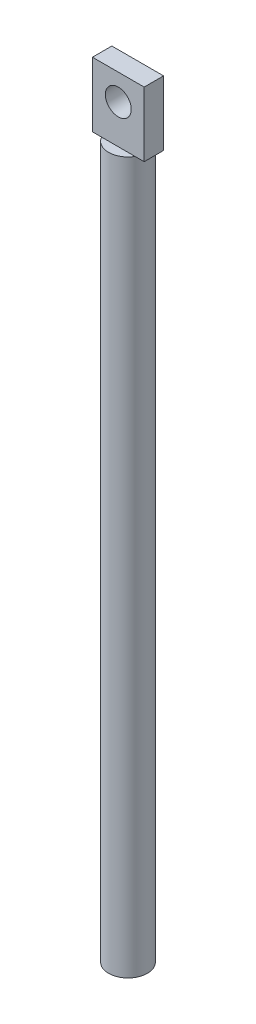
ISO-10303-21;
HEADER;
FILE_DESCRIPTION(('STEP AP214'),'2;1');
FILE_NAME('part.step','',(''),(''),'','','');
FILE_SCHEMA(('AUTOMOTIVE_DESIGN { 1 0 10303 214 1 1 1 1 }'));
ENDSEC;
DATA;
#1=APPLICATION_CONTEXT('core data for automotive mechanical design processes');
#2=APPLICATION_PROTOCOL_DEFINITION('international standard','automotive_design',2000,#1);
#3=PRODUCT_CONTEXT('',#1,'mechanical');
#4=PRODUCT('Part','Part','',(#3));
#5=PRODUCT_RELATED_PRODUCT_CATEGORY('part','',(#4));
#6=PRODUCT_DEFINITION_FORMATION('','',#4);
#7=PRODUCT_DEFINITION_CONTEXT('part definition',#1,'design');
#8=PRODUCT_DEFINITION('design','',#6,#7);
#9=PRODUCT_DEFINITION_SHAPE('','',#8);
#10=(LENGTH_UNIT() NAMED_UNIT(*) SI_UNIT(.MILLI.,.METRE.));
#11=(NAMED_UNIT(*) PLANE_ANGLE_UNIT() SI_UNIT($,.RADIAN.));
#12=(NAMED_UNIT(*) SI_UNIT($,.STERADIAN.) SOLID_ANGLE_UNIT());
#13=UNCERTAINTY_MEASURE_WITH_UNIT(LENGTH_MEASURE(1.E-05),#10,'distance_accuracy_value','');
#14=(GEOMETRIC_REPRESENTATION_CONTEXT(3) GLOBAL_UNCERTAINTY_ASSIGNED_CONTEXT((#13)) GLOBAL_UNIT_ASSIGNED_CONTEXT((#10,
#11,#12)) REPRESENTATION_CONTEXT('',''));
#15=CARTESIAN_POINT('',(0.,0.,0.));
#16=DIRECTION('',(0.,0.,1.));
#17=DIRECTION('',(1.,0.,0.));
#18=AXIS2_PLACEMENT_3D('',#15,#16,#17);
#19=CARTESIAN_POINT('',(0.,55.,0.));
#20=DIRECTION('',(0.,1.,0.));
#21=DIRECTION('',(0.,0.,1.));
#22=AXIS2_PLACEMENT_3D('',#19,#20,#21);
#23=PLANE('',#22);
#24=DIRECTION('',(1.,0.,0.));
#25=VECTOR('',#24,1.);
#26=CARTESIAN_POINT('',(-2.,55.,0.75));
#27=LINE('',#26,#25);
#28=CARTESIAN_POINT('',(-1.29903810567666,55.,0.75));
#29=VERTEX_POINT('',#28);
#30=CARTESIAN_POINT('',(1.29903810567666,55.,0.75));
#31=VERTEX_POINT('',#30);
#32=EDGE_CURVE('E11',#29,#31,#27,.T.);
#33=ORIENTED_EDGE('',*,*,#32,.F.);
#34=CARTESIAN_POINT('',(0.,55.,0.));
#35=DIRECTION('',(0.,1.,0.));
#36=DIRECTION('',(0.,0.,1.));
#37=AXIS2_PLACEMENT_3D('',#34,#35,#36);
#38=CIRCLE('',#37,1.5);
#39=EDGE_CURVE('E127',#29,#31,#38,.T.);
#40=ORIENTED_EDGE('',*,*,#39,.T.);
#41=EDGE_LOOP('',(#33,#40));
#42=FACE_BOUND('',#41,.T.);
#43=ADVANCED_FACE('F39',(#42),#23,.T.);
#44=CARTESIAN_POINT('',(0.,55.,0.));
#45=DIRECTION('',(0.,-1.,0.));
#46=DIRECTION('',(0.,0.,-1.));
#47=AXIS2_PLACEMENT_3D('',#44,#45,#46);
#48=CYLINDRICAL_SURFACE('',#47,1.5);
#49=CARTESIAN_POINT('',(1.29903810567666,55.,-0.75));
#50=VERTEX_POINT('',#49);
#51=EDGE_CURVE('E132',#31,#50,#38,.T.);
#52=ORIENTED_EDGE('',*,*,#51,.F.);
#53=ORIENTED_EDGE('',*,*,#39,.F.);
#54=CARTESIAN_POINT('',(-1.29903810567666,55.,-0.75));
#55=VERTEX_POINT('',#54);
#56=EDGE_CURVE('E144',#55,#29,#38,.T.);
#57=ORIENTED_EDGE('',*,*,#56,.F.);
#58=EDGE_CURVE('E135',#50,#55,#38,.T.);
#59=ORIENTED_EDGE('',*,*,#58,.F.);
#60=EDGE_LOOP('',(#52,#53,#57,#59));
#61=FACE_BOUND('',#60,.T.);
#62=CARTESIAN_POINT('',(0.,0.,0.));
#63=DIRECTION('',(0.,1.,0.));
#64=DIRECTION('',(0.,0.,1.));
#65=AXIS2_PLACEMENT_3D('',#62,#63,#64);
#66=CIRCLE('',#65,1.5);
#67=CARTESIAN_POINT('',(0.,0.,1.5));
#68=VERTEX_POINT('',#67);
#69=EDGE_CURVE('E122',#68,#68,#66,.T.);
#70=ORIENTED_EDGE('',*,*,#69,.T.);
#71=EDGE_LOOP('',(#70));
#72=FACE_BOUND('',#71,.T.);
#73=ADVANCED_FACE('F41',(#61,#72),#48,.T.);
#74=DIRECTION('',(-1.,0.,0.));
#75=VECTOR('',#74,1.);
#76=CARTESIAN_POINT('',(-2.,55.,-0.75));
#77=LINE('',#76,#75);
#78=EDGE_CURVE('E49',#50,#55,#77,.T.);
#79=ORIENTED_EDGE('',*,*,#78,.F.);
#80=ORIENTED_EDGE('',*,*,#58,.T.);
#81=EDGE_LOOP('',(#79,#80));
#82=FACE_BOUND('',#81,.T.);
#83=ADVANCED_FACE('F187',(#82),#23,.T.);
#84=CARTESIAN_POINT('',(0.,0.,0.));
#85=DIRECTION('',(0.,1.,0.));
#86=DIRECTION('',(0.,0.,1.));
#87=AXIS2_PLACEMENT_3D('',#84,#85,#86);
#88=PLANE('',#87);
#89=ORIENTED_EDGE('',*,*,#69,.F.);
#90=EDGE_LOOP('',(#89));
#91=FACE_BOUND('',#90,.T.);
#92=ADVANCED_FACE('F181',(#91),#88,.F.);
#93=CARTESIAN_POINT('',(0.,55.,0.));
#94=DIRECTION('',(0.,1.,0.));
#95=DIRECTION('',(0.,0.,1.));
#96=AXIS2_PLACEMENT_3D('',#93,#94,#95);
#97=PLANE('',#96);
#98=CARTESIAN_POINT('',(2.,55.,0.75));
#99=VERTEX_POINT('',#98);
#100=EDGE_CURVE('E52',#31,#99,#27,.T.);
#101=ORIENTED_EDGE('',*,*,#100,.F.);
#102=ORIENTED_EDGE('',*,*,#51,.T.);
#103=CARTESIAN_POINT('',(2.,55.,-0.75));
#104=VERTEX_POINT('',#103);
#105=EDGE_CURVE('E142',#104,#50,#77,.T.);
#106=ORIENTED_EDGE('',*,*,#105,.F.);
#107=DIRECTION('',(0.,0.,-1.));
#108=VECTOR('',#107,1.);
#109=CARTESIAN_POINT('',(2.,55.,-0.75));
#110=LINE('',#109,#108);
#111=EDGE_CURVE('E120',#99,#104,#110,.T.);
#112=ORIENTED_EDGE('',*,*,#111,.F.);
#113=EDGE_LOOP('',(#101,#102,#106,#112));
#114=FACE_BOUND('',#113,.T.);
#115=ADVANCED_FACE('F179',(#114),#97,.F.);
#116=CARTESIAN_POINT('',(-2.,55.,-0.75));
#117=VERTEX_POINT('',#116);
#118=EDGE_CURVE('E143',#55,#117,#77,.T.);
#119=ORIENTED_EDGE('',*,*,#118,.F.);
#120=ORIENTED_EDGE('',*,*,#56,.T.);
#121=CARTESIAN_POINT('',(-2.,55.,0.75));
#122=VERTEX_POINT('',#121);
#123=EDGE_CURVE('E51',#122,#29,#27,.T.);
#124=ORIENTED_EDGE('',*,*,#123,.F.);
#125=DIRECTION('',(0.,0.,1.));
#126=VECTOR('',#125,1.);
#127=CARTESIAN_POINT('',(-2.,55.,-0.75));
#128=LINE('',#127,#126);
#129=EDGE_CURVE('E162',#117,#122,#128,.T.);
#130=ORIENTED_EDGE('',*,*,#129,.F.);
#131=EDGE_LOOP('',(#119,#120,#124,#130));
#132=FACE_BOUND('',#131,.T.);
#133=ADVANCED_FACE('F153',(#132),#97,.F.);
#134=CARTESIAN_POINT('',(2.,60.,-0.75));
#135=DIRECTION('',(-1.,0.,0.));
#136=DIRECTION('',(0.,0.,1.));
#137=AXIS2_PLACEMENT_3D('',#134,#135,#136);
#138=PLANE('',#137);
#139=ORIENTED_EDGE('',*,*,#111,.T.);
#140=DIRECTION('',(0.,-1.,0.));
#141=VECTOR('',#140,1.);
#142=CARTESIAN_POINT('',(2.,60.,-0.75));
#143=LINE('',#142,#141);
#144=CARTESIAN_POINT('',(2.,60.,-0.75));
#145=VERTEX_POINT('',#144);
#146=EDGE_CURVE('E99',#145,#104,#143,.T.);
#147=ORIENTED_EDGE('',*,*,#146,.F.);
#148=DIRECTION('',(0.,0.,-1.));
#149=VECTOR('',#148,1.);
#150=CARTESIAN_POINT('',(2.,60.,-0.75));
#151=LINE('',#150,#149);
#152=CARTESIAN_POINT('',(2.,60.,0.75));
#153=VERTEX_POINT('',#152);
#154=EDGE_CURVE('E107',#153,#145,#151,.T.);
#155=ORIENTED_EDGE('',*,*,#154,.F.);
#156=DIRECTION('',(0.,-1.,0.));
#157=VECTOR('',#156,1.);
#158=CARTESIAN_POINT('',(2.,60.,0.75));
#159=LINE('',#158,#157);
#160=EDGE_CURVE('E165',#153,#99,#159,.T.);
#161=ORIENTED_EDGE('',*,*,#160,.T.);
#162=EDGE_LOOP('',(#139,#147,#155,#161));
#163=FACE_BOUND('',#162,.T.);
#164=ADVANCED_FACE('F118',(#163),#138,.F.);
#165=CARTESIAN_POINT('',(-2.,60.,-0.75));
#166=DIRECTION('',(0.,0.,1.));
#167=DIRECTION('',(1.,0.,0.));
#168=AXIS2_PLACEMENT_3D('',#165,#166,#167);
#169=PLANE('',#168);
#170=CARTESIAN_POINT('',(0.,58.,-0.75));
#171=DIRECTION('',(0.,0.,-1.));
#172=DIRECTION('',(-1.,0.,0.));
#173=AXIS2_PLACEMENT_3D('',#170,#171,#172);
#174=CIRCLE('',#173,1.);
#175=CARTESIAN_POINT('',(-1.,58.,-0.75));
#176=VERTEX_POINT('',#175);
#177=EDGE_CURVE('E282',#176,#176,#174,.T.);
#178=ORIENTED_EDGE('',*,*,#177,.F.);
#179=EDGE_LOOP('',(#178));
#180=FACE_BOUND('',#179,.T.);
#181=ORIENTED_EDGE('',*,*,#105,.T.);
#182=ORIENTED_EDGE('',*,*,#78,.T.);
#183=ORIENTED_EDGE('',*,*,#118,.T.);
#184=DIRECTION('',(0.,-1.,0.));
#185=VECTOR('',#184,1.);
#186=CARTESIAN_POINT('',(-2.,60.,-0.75));
#187=LINE('',#186,#185);
#188=CARTESIAN_POINT('',(-2.,60.,-0.75));
#189=VERTEX_POINT('',#188);
#190=EDGE_CURVE('E102',#189,#117,#187,.T.);
#191=ORIENTED_EDGE('',*,*,#190,.F.);
#192=DIRECTION('',(-1.,0.,0.));
#193=VECTOR('',#192,1.);
#194=CARTESIAN_POINT('',(-2.,60.,-0.75));
#195=LINE('',#194,#193);
#196=EDGE_CURVE('E94',#145,#189,#195,.T.);
#197=ORIENTED_EDGE('',*,*,#196,.F.);
#198=ORIENTED_EDGE('',*,*,#146,.T.);
#199=EDGE_LOOP('',(#181,#182,#183,#191,#197,#198));
#200=FACE_BOUND('',#199,.T.);
#201=ADVANCED_FACE('F97',(#180,#200),#169,.F.);
#202=CARTESIAN_POINT('',(-2.,60.,-0.75));
#203=DIRECTION('',(1.,0.,0.));
#204=DIRECTION('',(0.,0.,-1.));
#205=AXIS2_PLACEMENT_3D('',#202,#203,#204);
#206=PLANE('',#205);
#207=ORIENTED_EDGE('',*,*,#129,.T.);
#208=DIRECTION('',(0.,-1.,0.));
#209=VECTOR('',#208,1.);
#210=CARTESIAN_POINT('',(-2.,60.,0.75));
#211=LINE('',#210,#209);
#212=CARTESIAN_POINT('',(-2.,60.,0.75));
#213=VERTEX_POINT('',#212);
#214=EDGE_CURVE('E128',#213,#122,#211,.T.);
#215=ORIENTED_EDGE('',*,*,#214,.F.);
#216=DIRECTION('',(0.,0.,1.));
#217=VECTOR('',#216,1.);
#218=CARTESIAN_POINT('',(-2.,60.,-0.75));
#219=LINE('',#218,#217);
#220=EDGE_CURVE('E106',#189,#213,#219,.T.);
#221=ORIENTED_EDGE('',*,*,#220,.F.);
#222=ORIENTED_EDGE('',*,*,#190,.T.);
#223=EDGE_LOOP('',(#207,#215,#221,#222));
#224=FACE_BOUND('',#223,.T.);
#225=ADVANCED_FACE('F178',(#224),#206,.F.);
#226=CARTESIAN_POINT('',(-2.,60.,0.75));
#227=DIRECTION('',(0.,0.,-1.));
#228=DIRECTION('',(-1.,0.,0.));
#229=AXIS2_PLACEMENT_3D('',#226,#227,#228);
#230=PLANE('',#229);
#231=CARTESIAN_POINT('',(0.,58.,0.75));
#232=DIRECTION('',(0.,0.,-1.));
#233=DIRECTION('',(-1.,0.,0.));
#234=AXIS2_PLACEMENT_3D('',#231,#232,#233);
#235=CIRCLE('',#234,1.);
#236=CARTESIAN_POINT('',(-1.,58.,0.75));
#237=VERTEX_POINT('',#236);
#238=EDGE_CURVE('E43',#237,#237,#235,.T.);
#239=ORIENTED_EDGE('',*,*,#238,.T.);
#240=EDGE_LOOP('',(#239));
#241=FACE_BOUND('',#240,.T.);
#242=ORIENTED_EDGE('',*,*,#123,.T.);
#243=ORIENTED_EDGE('',*,*,#32,.T.);
#244=ORIENTED_EDGE('',*,*,#100,.T.);
#245=ORIENTED_EDGE('',*,*,#160,.F.);
#246=DIRECTION('',(1.,0.,0.));
#247=VECTOR('',#246,1.);
#248=CARTESIAN_POINT('',(-2.,60.,0.75));
#249=LINE('',#248,#247);
#250=EDGE_CURVE('E112',#213,#153,#249,.T.);
#251=ORIENTED_EDGE('',*,*,#250,.F.);
#252=ORIENTED_EDGE('',*,*,#214,.T.);
#253=EDGE_LOOP('',(#242,#243,#244,#245,#251,#252));
#254=FACE_BOUND('',#253,.T.);
#255=ADVANCED_FACE('F158',(#241,#254),#230,.F.);
#256=CARTESIAN_POINT('',(0.,60.,0.));
#257=DIRECTION('',(0.,1.,0.));
#258=DIRECTION('',(0.,0.,1.));
#259=AXIS2_PLACEMENT_3D('',#256,#257,#258);
#260=PLANE('',#259);
#261=ORIENTED_EDGE('',*,*,#154,.T.);
#262=ORIENTED_EDGE('',*,*,#196,.T.);
#263=ORIENTED_EDGE('',*,*,#220,.T.);
#264=ORIENTED_EDGE('',*,*,#250,.T.);
#265=EDGE_LOOP('',(#261,#262,#263,#264));
#266=FACE_BOUND('',#265,.T.);
#267=ADVANCED_FACE('F110',(#266),#260,.T.);
#268=CARTESIAN_POINT('',(0.,58.,1.5));
#269=DIRECTION('',(0.,0.,-1.));
#270=DIRECTION('',(-1.,0.,0.));
#271=AXIS2_PLACEMENT_3D('',#268,#269,#270);
#272=CYLINDRICAL_SURFACE('',#271,1.);
#273=ORIENTED_EDGE('',*,*,#177,.T.);
#274=EDGE_LOOP('',(#273));
#275=FACE_BOUND('',#274,.T.);
#276=ORIENTED_EDGE('',*,*,#238,.F.);
#277=EDGE_LOOP('',(#276));
#278=FACE_BOUND('',#277,.T.);
#279=ADVANCED_FACE('F264',(#275,#278),#272,.F.);
#280=CLOSED_SHELL('',(#43,#73,#83,#92,#115,#133,#164,#201,#225,#255,#267,#279));
#281=MANIFOLD_SOLID_BREP('B2',#280);
#282=ADVANCED_BREP_SHAPE_REPRESENTATION('',(#18,#281),#14);
#283=SHAPE_DEFINITION_REPRESENTATION(#9,#282);
ENDSEC;
END-ISO-10303-21;
